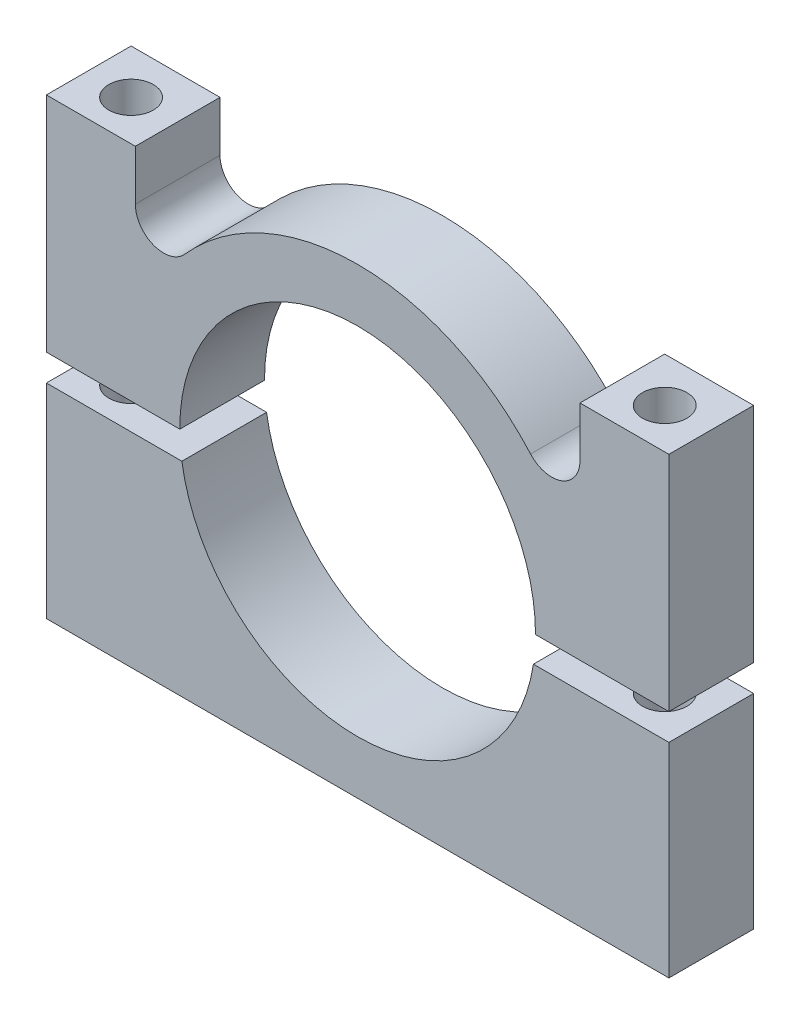
ISO-10303-21;
HEADER;
FILE_DESCRIPTION(('STEP AP214'),'2;1');
FILE_NAME('part.step','',(''),(''),'','','');
FILE_SCHEMA(('AUTOMOTIVE_DESIGN { 1 0 10303 214 1 1 1 1 }'));
ENDSEC;
DATA;
#1=APPLICATION_CONTEXT('core data for automotive mechanical design processes');
#2=APPLICATION_PROTOCOL_DEFINITION('international standard','automotive_design',2000,#1);
#3=PRODUCT_CONTEXT('',#1,'mechanical');
#4=PRODUCT('Part','Part','',(#3));
#5=PRODUCT_RELATED_PRODUCT_CATEGORY('part','',(#4));
#6=PRODUCT_DEFINITION_FORMATION('','',#4);
#7=PRODUCT_DEFINITION_CONTEXT('part definition',#1,'design');
#8=PRODUCT_DEFINITION('design','',#6,#7);
#9=PRODUCT_DEFINITION_SHAPE('','',#8);
#10=(LENGTH_UNIT() NAMED_UNIT(*) SI_UNIT(.MILLI.,.METRE.));
#11=(NAMED_UNIT(*) PLANE_ANGLE_UNIT() SI_UNIT($,.RADIAN.));
#12=(NAMED_UNIT(*) SI_UNIT($,.STERADIAN.) SOLID_ANGLE_UNIT());
#13=UNCERTAINTY_MEASURE_WITH_UNIT(LENGTH_MEASURE(1.E-05),#10,'distance_accuracy_value','');
#14=(GEOMETRIC_REPRESENTATION_CONTEXT(3) GLOBAL_UNCERTAINTY_ASSIGNED_CONTEXT((#13)) GLOBAL_UNIT_ASSIGNED_CONTEXT((#10,
#11,#12)) REPRESENTATION_CONTEXT('',''));
#15=CARTESIAN_POINT('',(0.,0.,0.));
#16=DIRECTION('',(0.,0.,1.));
#17=DIRECTION('',(1.,0.,0.));
#18=AXIS2_PLACEMENT_3D('',#15,#16,#17);
#19=CARTESIAN_POINT('',(-17.5,-0.0264974554359716,4.763));
#20=DIRECTION('',(1.,0.,0.));
#21=DIRECTION('',(0.,0.,-1.));
#22=AXIS2_PLACEMENT_3D('',#19,#20,#21);
#23=PLANE('',#22);
#24=DIRECTION('',(0.,-1.,0.));
#25=VECTOR('',#24,1.);
#26=CARTESIAN_POINT('',(-17.5,-0.0264974554359716,0.));
#27=LINE('',#26,#25);
#28=CARTESIAN_POINT('',(-17.5,12.5,0.));
#29=VERTEX_POINT('',#28);
#30=CARTESIAN_POINT('',(-17.5,-0.0264974554359716,0.));
#31=VERTEX_POINT('',#30);
#32=EDGE_CURVE('E163',#29,#31,#27,.T.);
#33=ORIENTED_EDGE('',*,*,#32,.T.);
#34=DIRECTION('',(0.,0.,-1.));
#35=VECTOR('',#34,1.);
#36=CARTESIAN_POINT('',(-17.5,-0.0264974554359716,4.763));
#37=LINE('',#36,#35);
#38=CARTESIAN_POINT('',(-17.5,-0.0264974554359716,4.763));
#39=VERTEX_POINT('',#38);
#40=EDGE_CURVE('E12',#39,#31,#37,.T.);
#41=ORIENTED_EDGE('',*,*,#40,.F.);
#42=DIRECTION('',(0.,-1.,0.));
#43=VECTOR('',#42,1.);
#44=CARTESIAN_POINT('',(-17.5,-0.0264974554359716,4.763));
#45=LINE('',#44,#43);
#46=CARTESIAN_POINT('',(-17.5,12.5,4.763));
#47=VERTEX_POINT('',#46);
#48=EDGE_CURVE('E186',#47,#39,#45,.T.);
#49=ORIENTED_EDGE('',*,*,#48,.F.);
#50=DIRECTION('',(0.,0.,-1.));
#51=VECTOR('',#50,1.);
#52=CARTESIAN_POINT('',(-17.5,12.5,4.763));
#53=LINE('',#52,#51);
#54=EDGE_CURVE('E159',#47,#29,#53,.T.);
#55=ORIENTED_EDGE('',*,*,#54,.T.);
#56=EDGE_LOOP('',(#33,#41,#49,#55));
#57=FACE_BOUND('',#56,.T.);
#58=ADVANCED_FACE('F43',(#57),#23,.F.);
#59=CARTESIAN_POINT('',(-17.5,-0.0264974554359716,4.763));
#60=DIRECTION('',(0.,1.,0.));
#61=DIRECTION('',(0.,0.,1.));
#62=AXIS2_PLACEMENT_3D('',#59,#60,#61);
#63=PLANE('',#62);
#64=CARTESIAN_POINT('',(-15.0028099543165,-0.0264974554359722,2.49999842083085));
#65=DIRECTION('',(0.,1.,0.));
#66=DIRECTION('',(0.,0.,1.));
#67=AXIS2_PLACEMENT_3D('',#64,#65,#66);
#68=CIRCLE('',#67,1.24999999999999);
#69=CARTESIAN_POINT('',(-15.0028099543165,-0.0264974554359722,3.74999842083084));
#70=VERTEX_POINT('',#69);
#71=EDGE_CURVE('E167',#70,#70,#68,.T.);
#72=ORIENTED_EDGE('',*,*,#71,.T.);
#73=EDGE_LOOP('',(#72));
#74=FACE_BOUND('',#73,.T.);
#75=DIRECTION('',(1.,0.,0.));
#76=VECTOR('',#75,1.);
#77=CARTESIAN_POINT('',(-17.5,-0.0264974554359716,0.));
#78=LINE('',#77,#76);
#79=CARTESIAN_POINT('',(-9.99996489418115,-0.0264974554359728,0.));
#80=VERTEX_POINT('',#79);
#81=EDGE_CURVE('E166',#31,#80,#78,.T.);
#82=ORIENTED_EDGE('',*,*,#81,.T.);
#83=DIRECTION('',(0.,0.,-1.));
#84=VECTOR('',#83,1.);
#85=CARTESIAN_POINT('',(-9.99996489418115,-0.0264974554359728,4.763));
#86=LINE('',#85,#84);
#87=CARTESIAN_POINT('',(-9.99996489418115,-0.0264974554359728,4.763));
#88=VERTEX_POINT('',#87);
#89=EDGE_CURVE('E51',#88,#80,#86,.T.);
#90=ORIENTED_EDGE('',*,*,#89,.F.);
#91=DIRECTION('',(1.,0.,0.));
#92=VECTOR('',#91,1.);
#93=CARTESIAN_POINT('',(-17.5,-0.0264974554359716,4.763));
#94=LINE('',#93,#92);
#95=EDGE_CURVE('E114',#39,#88,#94,.T.);
#96=ORIENTED_EDGE('',*,*,#95,.F.);
#97=ORIENTED_EDGE('',*,*,#40,.T.);
#98=EDGE_LOOP('',(#82,#90,#96,#97));
#99=FACE_BOUND('',#98,.T.);
#100=ADVANCED_FACE('F266',(#74,#99),#63,.F.);
#101=CARTESIAN_POINT('',(0.,0.,4.763));
#102=DIRECTION('',(0.,0.,-1.));
#103=DIRECTION('',(-1.,0.,0.));
#104=AXIS2_PLACEMENT_3D('',#101,#102,#103);
#105=CYLINDRICAL_SURFACE('',#104,10.);
#106=CARTESIAN_POINT('',(0.,0.,0.));
#107=DIRECTION('',(0.,0.,-1.));
#108=DIRECTION('',(1.,0.,0.));
#109=AXIS2_PLACEMENT_3D('',#106,#107,#108);
#110=CIRCLE('',#109,10.);
#111=CARTESIAN_POINT('',(9.99996489418115,-0.0264974554359716,0.));
#112=VERTEX_POINT('',#111);
#113=EDGE_CURVE('E169',#80,#112,#110,.T.);
#114=ORIENTED_EDGE('',*,*,#113,.T.);
#115=DIRECTION('',(0.,0.,-1.));
#116=VECTOR('',#115,1.);
#117=CARTESIAN_POINT('',(9.99996489418115,-0.0264974554359716,4.763));
#118=LINE('',#117,#116);
#119=CARTESIAN_POINT('',(9.99996489418115,-0.0264974554359716,4.763));
#120=VERTEX_POINT('',#119);
#121=EDGE_CURVE('E205',#120,#112,#118,.T.);
#122=ORIENTED_EDGE('',*,*,#121,.F.);
#123=CARTESIAN_POINT('',(0.,0.,4.763));
#124=DIRECTION('',(0.,0.,-1.));
#125=DIRECTION('',(1.,0.,0.));
#126=AXIS2_PLACEMENT_3D('',#123,#124,#125);
#127=CIRCLE('',#126,10.);
#128=EDGE_CURVE('E213',#88,#120,#127,.T.);
#129=ORIENTED_EDGE('',*,*,#128,.F.);
#130=ORIENTED_EDGE('',*,*,#89,.T.);
#131=EDGE_LOOP('',(#114,#122,#129,#130));
#132=FACE_BOUND('',#131,.T.);
#133=ADVANCED_FACE('F211',(#132),#105,.F.);
#134=CARTESIAN_POINT('',(9.99996489418115,-0.0264974554359716,4.763));
#135=DIRECTION('',(0.,1.,0.));
#136=DIRECTION('',(0.,0.,1.));
#137=AXIS2_PLACEMENT_3D('',#134,#135,#136);
#138=PLANE('',#137);
#139=CARTESIAN_POINT('',(15.0028099543165,-0.0264974554359722,2.49999842083085));
#140=DIRECTION('',(0.,1.,0.));
#141=DIRECTION('',(0.,0.,1.));
#142=AXIS2_PLACEMENT_3D('',#139,#140,#141);
#143=CIRCLE('',#142,1.24999999999999);
#144=CARTESIAN_POINT('',(15.0028099543165,-0.0264974554359722,3.74999842083084));
#145=VERTEX_POINT('',#144);
#146=EDGE_CURVE('E370',#145,#145,#143,.T.);
#147=ORIENTED_EDGE('',*,*,#146,.T.);
#148=EDGE_LOOP('',(#147));
#149=FACE_BOUND('',#148,.T.);
#150=DIRECTION('',(1.,0.,0.));
#151=VECTOR('',#150,1.);
#152=CARTESIAN_POINT('',(9.99996489418115,-0.0264974554359716,0.));
#153=LINE('',#152,#151);
#154=CARTESIAN_POINT('',(17.5,-0.0264974554359716,0.));
#155=VERTEX_POINT('',#154);
#156=EDGE_CURVE('E171',#112,#155,#153,.T.);
#157=ORIENTED_EDGE('',*,*,#156,.T.);
#158=DIRECTION('',(0.,0.,-1.));
#159=VECTOR('',#158,1.);
#160=CARTESIAN_POINT('',(17.5,-0.0264974554359716,4.763));
#161=LINE('',#160,#159);
#162=CARTESIAN_POINT('',(17.5,-0.0264974554359716,4.763));
#163=VERTEX_POINT('',#162);
#164=EDGE_CURVE('E202',#163,#155,#161,.T.);
#165=ORIENTED_EDGE('',*,*,#164,.F.);
#166=DIRECTION('',(1.,0.,0.));
#167=VECTOR('',#166,1.);
#168=CARTESIAN_POINT('',(9.99996489418115,-0.0264974554359716,4.763));
#169=LINE('',#168,#167);
#170=EDGE_CURVE('E231',#120,#163,#169,.T.);
#171=ORIENTED_EDGE('',*,*,#170,.F.);
#172=ORIENTED_EDGE('',*,*,#121,.T.);
#173=EDGE_LOOP('',(#157,#165,#171,#172));
#174=FACE_BOUND('',#173,.T.);
#175=ADVANCED_FACE('F222',(#149,#174),#138,.F.);
#176=CARTESIAN_POINT('',(17.5,12.5,4.763));
#177=DIRECTION('',(-1.,0.,0.));
#178=DIRECTION('',(0.,-1.,0.));
#179=AXIS2_PLACEMENT_3D('',#176,#177,#178);
#180=PLANE('',#179);
#181=DIRECTION('',(0.,1.,0.));
#182=VECTOR('',#181,1.);
#183=CARTESIAN_POINT('',(17.5,12.5,0.));
#184=LINE('',#183,#182);
#185=CARTESIAN_POINT('',(17.5,12.5,0.));
#186=VERTEX_POINT('',#185);
#187=EDGE_CURVE('E173',#155,#186,#184,.T.);
#188=ORIENTED_EDGE('',*,*,#187,.T.);
#189=DIRECTION('',(0.,0.,-1.));
#190=VECTOR('',#189,1.);
#191=CARTESIAN_POINT('',(17.5,12.5,4.763));
#192=LINE('',#191,#190);
#193=CARTESIAN_POINT('',(17.5,12.5,4.763));
#194=VERTEX_POINT('',#193);
#195=EDGE_CURVE('E199',#194,#186,#192,.T.);
#196=ORIENTED_EDGE('',*,*,#195,.F.);
#197=DIRECTION('',(0.,1.,0.));
#198=VECTOR('',#197,1.);
#199=CARTESIAN_POINT('',(17.5,12.5,4.763));
#200=LINE('',#199,#198);
#201=EDGE_CURVE('E228',#163,#194,#200,.T.);
#202=ORIENTED_EDGE('',*,*,#201,.F.);
#203=ORIENTED_EDGE('',*,*,#164,.T.);
#204=EDGE_LOOP('',(#188,#196,#202,#203));
#205=FACE_BOUND('',#204,.T.);
#206=ADVANCED_FACE('F226',(#205),#180,.F.);
#207=CARTESIAN_POINT('',(12.5,12.5,4.763));
#208=DIRECTION('',(0.,-1.,0.));
#209=DIRECTION('',(0.,0.,-1.));
#210=AXIS2_PLACEMENT_3D('',#207,#208,#209);
#211=PLANE('',#210);
#212=CARTESIAN_POINT('',(15.0028099543165,12.5,2.49999842083085));
#213=DIRECTION('',(0.,1.,0.));
#214=DIRECTION('',(0.,0.,1.));
#215=AXIS2_PLACEMENT_3D('',#212,#213,#214);
#216=CIRCLE('',#215,1.24999999999999);
#217=CARTESIAN_POINT('',(15.0028099543165,12.5,3.74999842083084));
#218=VERTEX_POINT('',#217);
#219=EDGE_CURVE('E367',#218,#218,#216,.T.);
#220=ORIENTED_EDGE('',*,*,#219,.F.);
#221=EDGE_LOOP('',(#220));
#222=FACE_BOUND('',#221,.T.);
#223=DIRECTION('',(-1.,0.,0.));
#224=VECTOR('',#223,1.);
#225=CARTESIAN_POINT('',(12.5,12.5,0.));
#226=LINE('',#225,#224);
#227=CARTESIAN_POINT('',(12.5,12.5,0.));
#228=VERTEX_POINT('',#227);
#229=EDGE_CURVE('E175',#186,#228,#226,.T.);
#230=ORIENTED_EDGE('',*,*,#229,.T.);
#231=DIRECTION('',(0.,0.,-1.));
#232=VECTOR('',#231,1.);
#233=CARTESIAN_POINT('',(12.5,12.5,4.763));
#234=LINE('',#233,#232);
#235=CARTESIAN_POINT('',(12.5,12.5,4.763));
#236=VERTEX_POINT('',#235);
#237=EDGE_CURVE('E196',#236,#228,#234,.T.);
#238=ORIENTED_EDGE('',*,*,#237,.F.);
#239=DIRECTION('',(-1.,0.,0.));
#240=VECTOR('',#239,1.);
#241=CARTESIAN_POINT('',(12.5,12.5,4.763));
#242=LINE('',#241,#240);
#243=EDGE_CURVE('E230',#194,#236,#242,.T.);
#244=ORIENTED_EDGE('',*,*,#243,.F.);
#245=ORIENTED_EDGE('',*,*,#195,.T.);
#246=EDGE_LOOP('',(#230,#238,#244,#245));
#247=FACE_BOUND('',#246,.T.);
#248=ADVANCED_FACE('F282',(#222,#247),#211,.F.);
#249=CARTESIAN_POINT('',(12.5,12.5,4.763));
#250=DIRECTION('',(1.,0.,0.));
#251=DIRECTION('',(0.,0.,-1.));
#252=AXIS2_PLACEMENT_3D('',#249,#250,#251);
#253=PLANE('',#252);
#254=DIRECTION('',(0.,-1.,0.));
#255=VECTOR('',#254,1.);
#256=CARTESIAN_POINT('',(12.5,12.5,0.));
#257=LINE('',#256,#255);
#258=CARTESIAN_POINT('',(12.5,9.68052168015753,0.));
#259=VERTEX_POINT('',#258);
#260=EDGE_CURVE('E177',#228,#259,#257,.T.);
#261=ORIENTED_EDGE('',*,*,#260,.T.);
#262=DIRECTION('',(0.,0.,-1.));
#263=VECTOR('',#262,1.);
#264=CARTESIAN_POINT('',(12.5,9.68052168015753,4.763));
#265=LINE('',#264,#263);
#266=CARTESIAN_POINT('',(12.5,9.68052168015753,4.763));
#267=VERTEX_POINT('',#266);
#268=EDGE_CURVE('E193',#267,#259,#265,.T.);
#269=ORIENTED_EDGE('',*,*,#268,.F.);
#270=DIRECTION('',(0.,-1.,0.));
#271=VECTOR('',#270,1.);
#272=CARTESIAN_POINT('',(12.5,12.5,4.763));
#273=LINE('',#272,#271);
#274=EDGE_CURVE('E233',#236,#267,#273,.T.);
#275=ORIENTED_EDGE('',*,*,#274,.F.);
#276=ORIENTED_EDGE('',*,*,#237,.T.);
#277=EDGE_LOOP('',(#261,#269,#275,#276));
#278=FACE_BOUND('',#277,.T.);
#279=ADVANCED_FACE('F285',(#278),#253,.F.);
#280=CARTESIAN_POINT('',(10.9125,9.68052168015753,4.763));
#281=DIRECTION('',(0.,0.,-1.));
#282=DIRECTION('',(-1.,0.,0.));
#283=AXIS2_PLACEMENT_3D('',#280,#281,#282);
#284=CYLINDRICAL_SURFACE('',#283,1.5875);
#285=CARTESIAN_POINT('',(10.9125,9.68052168015753,0.));
#286=DIRECTION('',(0.,0.,-1.));
#287=DIRECTION('',(-1.,0.,0.));
#288=AXIS2_PLACEMENT_3D('',#285,#286,#287);
#289=CIRCLE('',#288,1.5875);
#290=CARTESIAN_POINT('',(9.72493573264782,8.62702874666996,0.));
#291=VERTEX_POINT('',#290);
#292=EDGE_CURVE('E179',#259,#291,#289,.T.);
#293=ORIENTED_EDGE('',*,*,#292,.T.);
#294=DIRECTION('',(0.,0.,-1.));
#295=VECTOR('',#294,1.);
#296=CARTESIAN_POINT('',(9.72493573264782,8.62702874666996,4.763));
#297=LINE('',#296,#295);
#298=CARTESIAN_POINT('',(9.72493573264782,8.62702874666996,4.763));
#299=VERTEX_POINT('',#298);
#300=EDGE_CURVE('E190',#299,#291,#297,.T.);
#301=ORIENTED_EDGE('',*,*,#300,.F.);
#302=CARTESIAN_POINT('',(10.9125,9.68052168015753,4.763));
#303=DIRECTION('',(0.,0.,-1.));
#304=DIRECTION('',(-1.,0.,0.));
#305=AXIS2_PLACEMENT_3D('',#302,#303,#304);
#306=CIRCLE('',#305,1.5875);
#307=EDGE_CURVE('E239',#267,#299,#306,.T.);
#308=ORIENTED_EDGE('',*,*,#307,.F.);
#309=ORIENTED_EDGE('',*,*,#268,.T.);
#310=EDGE_LOOP('',(#293,#301,#308,#309));
#311=FACE_BOUND('',#310,.T.);
#312=ADVANCED_FACE('F245',(#311),#284,.F.);
#313=CARTESIAN_POINT('',(0.,0.,4.763));
#314=DIRECTION('',(0.,0.,-1.));
#315=DIRECTION('',(-1.,0.,0.));
#316=AXIS2_PLACEMENT_3D('',#313,#314,#315);
#317=CYLINDRICAL_SURFACE('',#316,13.);
#318=CARTESIAN_POINT('',(0.,0.,0.));
#319=DIRECTION('',(0.,0.,1.));
#320=DIRECTION('',(1.,0.,0.));
#321=AXIS2_PLACEMENT_3D('',#318,#319,#320);
#322=CIRCLE('',#321,13.);
#323=CARTESIAN_POINT('',(-9.72493573264782,8.62702874666995,0.));
#324=VERTEX_POINT('',#323);
#325=EDGE_CURVE('E181',#291,#324,#322,.T.);
#326=ORIENTED_EDGE('',*,*,#325,.T.);
#327=DIRECTION('',(0.,0.,-1.));
#328=VECTOR('',#327,1.);
#329=CARTESIAN_POINT('',(-9.72493573264782,8.62702874666995,4.763));
#330=LINE('',#329,#328);
#331=CARTESIAN_POINT('',(-9.72493573264782,8.62702874666995,4.763));
#332=VERTEX_POINT('',#331);
#333=EDGE_CURVE('E154',#332,#324,#330,.T.);
#334=ORIENTED_EDGE('',*,*,#333,.F.);
#335=CARTESIAN_POINT('',(0.,0.,4.763));
#336=DIRECTION('',(0.,0.,1.));
#337=DIRECTION('',(1.,0.,0.));
#338=AXIS2_PLACEMENT_3D('',#335,#336,#337);
#339=CIRCLE('',#338,13.);
#340=EDGE_CURVE('E145',#299,#332,#339,.T.);
#341=ORIENTED_EDGE('',*,*,#340,.F.);
#342=ORIENTED_EDGE('',*,*,#300,.T.);
#343=EDGE_LOOP('',(#326,#334,#341,#342));
#344=FACE_BOUND('',#343,.T.);
#345=ADVANCED_FACE('F249',(#344),#317,.T.);
#346=CARTESIAN_POINT('',(-10.9125,9.68052168015753,4.763));
#347=DIRECTION('',(0.,0.,-1.));
#348=DIRECTION('',(-1.,0.,0.));
#349=AXIS2_PLACEMENT_3D('',#346,#347,#348);
#350=CYLINDRICAL_SURFACE('',#349,1.5875);
#351=CARTESIAN_POINT('',(-10.9125,9.68052168015753,0.));
#352=DIRECTION('',(0.,0.,-1.));
#353=DIRECTION('',(-1.,0.,0.));
#354=AXIS2_PLACEMENT_3D('',#351,#352,#353);
#355=CIRCLE('',#354,1.5875);
#356=CARTESIAN_POINT('',(-12.5,9.68052168015753,0.));
#357=VERTEX_POINT('',#356);
#358=EDGE_CURVE('E153',#324,#357,#355,.T.);
#359=ORIENTED_EDGE('',*,*,#358,.T.);
#360=DIRECTION('',(0.,0.,-1.));
#361=VECTOR('',#360,1.);
#362=CARTESIAN_POINT('',(-12.5,9.68052168015753,4.763));
#363=LINE('',#362,#361);
#364=CARTESIAN_POINT('',(-12.5,9.68052168015753,4.763));
#365=VERTEX_POINT('',#364);
#366=EDGE_CURVE('E150',#365,#357,#363,.T.);
#367=ORIENTED_EDGE('',*,*,#366,.F.);
#368=CARTESIAN_POINT('',(-10.9125,9.68052168015753,4.763));
#369=DIRECTION('',(0.,0.,-1.));
#370=DIRECTION('',(-1.,0.,0.));
#371=AXIS2_PLACEMENT_3D('',#368,#369,#370);
#372=CIRCLE('',#371,1.5875);
#373=EDGE_CURVE('E139',#332,#365,#372,.T.);
#374=ORIENTED_EDGE('',*,*,#373,.F.);
#375=ORIENTED_EDGE('',*,*,#333,.T.);
#376=EDGE_LOOP('',(#359,#367,#374,#375));
#377=FACE_BOUND('',#376,.T.);
#378=ADVANCED_FACE('F151',(#377),#350,.F.);
#379=CARTESIAN_POINT('',(-12.5,12.5,4.763));
#380=DIRECTION('',(-1.,0.,0.));
#381=DIRECTION('',(0.,0.,1.));
#382=AXIS2_PLACEMENT_3D('',#379,#380,#381);
#383=PLANE('',#382);
#384=DIRECTION('',(0.,1.,0.));
#385=VECTOR('',#384,1.);
#386=CARTESIAN_POINT('',(-12.5,12.5,0.));
#387=LINE('',#386,#385);
#388=CARTESIAN_POINT('',(-12.5,12.5,0.));
#389=VERTEX_POINT('',#388);
#390=EDGE_CURVE('E100',#357,#389,#387,.T.);
#391=ORIENTED_EDGE('',*,*,#390,.T.);
#392=DIRECTION('',(0.,0.,-1.));
#393=VECTOR('',#392,1.);
#394=CARTESIAN_POINT('',(-12.5,12.5,4.763));
#395=LINE('',#394,#393);
#396=CARTESIAN_POINT('',(-12.5,12.5,4.763));
#397=VERTEX_POINT('',#396);
#398=EDGE_CURVE('E155',#397,#389,#395,.T.);
#399=ORIENTED_EDGE('',*,*,#398,.F.);
#400=DIRECTION('',(0.,1.,0.));
#401=VECTOR('',#400,1.);
#402=CARTESIAN_POINT('',(-12.5,12.5,4.763));
#403=LINE('',#402,#401);
#404=EDGE_CURVE('E143',#365,#397,#403,.T.);
#405=ORIENTED_EDGE('',*,*,#404,.F.);
#406=ORIENTED_EDGE('',*,*,#366,.T.);
#407=EDGE_LOOP('',(#391,#399,#405,#406));
#408=FACE_BOUND('',#407,.T.);
#409=ADVANCED_FACE('F157',(#408),#383,.F.);
#410=CARTESIAN_POINT('',(-17.5,12.5,4.763));
#411=DIRECTION('',(0.,-1.,0.));
#412=DIRECTION('',(0.,0.,-1.));
#413=AXIS2_PLACEMENT_3D('',#410,#411,#412);
#414=PLANE('',#413);
#415=CARTESIAN_POINT('',(-15.0028099543165,12.5,2.49999842083085));
#416=DIRECTION('',(0.,1.,0.));
#417=DIRECTION('',(0.,0.,1.));
#418=AXIS2_PLACEMENT_3D('',#415,#416,#417);
#419=CIRCLE('',#418,1.24999999999999);
#420=CARTESIAN_POINT('',(-15.0028099543165,12.5,3.74999842083084));
#421=VERTEX_POINT('',#420);
#422=EDGE_CURVE('E371',#421,#421,#419,.T.);
#423=ORIENTED_EDGE('',*,*,#422,.F.);
#424=EDGE_LOOP('',(#423));
#425=FACE_BOUND('',#424,.T.);
#426=DIRECTION('',(-1.,0.,0.));
#427=VECTOR('',#426,1.);
#428=CARTESIAN_POINT('',(-17.5,12.5,0.));
#429=LINE('',#428,#427);
#430=EDGE_CURVE('E106',#389,#29,#429,.T.);
#431=ORIENTED_EDGE('',*,*,#430,.T.);
#432=ORIENTED_EDGE('',*,*,#54,.F.);
#433=DIRECTION('',(-1.,0.,0.));
#434=VECTOR('',#433,1.);
#435=CARTESIAN_POINT('',(-17.5,12.5,4.763));
#436=LINE('',#435,#434);
#437=EDGE_CURVE('E59',#397,#47,#436,.T.);
#438=ORIENTED_EDGE('',*,*,#437,.F.);
#439=ORIENTED_EDGE('',*,*,#398,.T.);
#440=EDGE_LOOP('',(#431,#432,#438,#439));
#441=FACE_BOUND('',#440,.T.);
#442=ADVANCED_FACE('F253',(#425,#441),#414,.F.);
#443=CARTESIAN_POINT('',(-10.9125,9.68052168015753,4.763));
#444=DIRECTION('',(0.,0.,-1.));
#445=DIRECTION('',(-1.,0.,0.));
#446=AXIS2_PLACEMENT_3D('',#443,#444,#445);
#447=PLANE('',#446);
#448=ORIENTED_EDGE('',*,*,#48,.T.);
#449=ORIENTED_EDGE('',*,*,#95,.T.);
#450=ORIENTED_EDGE('',*,*,#128,.T.);
#451=ORIENTED_EDGE('',*,*,#170,.T.);
#452=ORIENTED_EDGE('',*,*,#201,.T.);
#453=ORIENTED_EDGE('',*,*,#243,.T.);
#454=ORIENTED_EDGE('',*,*,#274,.T.);
#455=ORIENTED_EDGE('',*,*,#307,.T.);
#456=ORIENTED_EDGE('',*,*,#340,.T.);
#457=ORIENTED_EDGE('',*,*,#373,.T.);
#458=ORIENTED_EDGE('',*,*,#404,.T.);
#459=ORIENTED_EDGE('',*,*,#437,.T.);
#460=EDGE_LOOP('',(#448,#449,#450,#451,#452,#453,#454,#455,#456,#457,#458,#459));
#461=FACE_BOUND('',#460,.T.);
#462=ADVANCED_FACE('F141',(#461),#447,.F.);
#463=CARTESIAN_POINT('',(-10.9125,9.68052168015753,0.));
#464=DIRECTION('',(0.,0.,-1.));
#465=DIRECTION('',(-1.,0.,0.));
#466=AXIS2_PLACEMENT_3D('',#463,#464,#465);
#467=PLANE('',#466);
#468=ORIENTED_EDGE('',*,*,#32,.F.);
#469=ORIENTED_EDGE('',*,*,#430,.F.);
#470=ORIENTED_EDGE('',*,*,#390,.F.);
#471=ORIENTED_EDGE('',*,*,#358,.F.);
#472=ORIENTED_EDGE('',*,*,#325,.F.);
#473=ORIENTED_EDGE('',*,*,#292,.F.);
#474=ORIENTED_EDGE('',*,*,#260,.F.);
#475=ORIENTED_EDGE('',*,*,#229,.F.);
#476=ORIENTED_EDGE('',*,*,#187,.F.);
#477=ORIENTED_EDGE('',*,*,#156,.F.);
#478=ORIENTED_EDGE('',*,*,#113,.F.);
#479=ORIENTED_EDGE('',*,*,#81,.F.);
#480=EDGE_LOOP('',(#468,#469,#470,#471,#472,#473,#474,#475,#476,#477,#478,#479));
#481=FACE_BOUND('',#480,.T.);
#482=ADVANCED_FACE('F217',(#481),#467,.T.);
#483=CARTESIAN_POINT('',(-15.0028099543165,12.5,2.49999842083085));
#484=DIRECTION('',(0.,1.,0.));
#485=DIRECTION('',(0.,0.,1.));
#486=AXIS2_PLACEMENT_3D('',#483,#484,#485);
#487=CYLINDRICAL_SURFACE('',#486,1.24999999999999);
#488=ORIENTED_EDGE('',*,*,#422,.T.);
#489=EDGE_LOOP('',(#488));
#490=FACE_BOUND('',#489,.T.);
#491=ORIENTED_EDGE('',*,*,#71,.F.);
#492=EDGE_LOOP('',(#491));
#493=FACE_BOUND('',#492,.T.);
#494=ADVANCED_FACE('F318',(#490,#493),#487,.F.);
#495=CARTESIAN_POINT('',(15.0028099543165,12.5,2.49999842083085));
#496=DIRECTION('',(0.,1.,0.));
#497=DIRECTION('',(0.,0.,1.));
#498=AXIS2_PLACEMENT_3D('',#495,#496,#497);
#499=CYLINDRICAL_SURFACE('',#498,1.24999999999999);
#500=ORIENTED_EDGE('',*,*,#219,.T.);
#501=EDGE_LOOP('',(#500));
#502=FACE_BOUND('',#501,.T.);
#503=ORIENTED_EDGE('',*,*,#146,.F.);
#504=EDGE_LOOP('',(#503));
#505=FACE_BOUND('',#504,.T.);
#506=ADVANCED_FACE('F336',(#502,#505),#499,.F.);
#507=CLOSED_SHELL('',(#58,#100,#133,#175,#206,#248,#279,#312,#345,#378,#409,#442,#462,#482,#494,#506));
#508=MANIFOLD_SOLID_BREP('B2',#507);
#509=CARTESIAN_POINT('',(0.,0.,4.763));
#510=DIRECTION('',(0.,0.,-1.));
#511=DIRECTION('',(-1.,0.,0.));
#512=AXIS2_PLACEMENT_3D('',#509,#510,#511);
#513=CYLINDRICAL_SURFACE('',#512,10.);
#514=CARTESIAN_POINT('',(0.,0.,0.));
#515=DIRECTION('',(0.,0.,-1.));
#516=DIRECTION('',(1.,0.,0.));
#517=AXIS2_PLACEMENT_3D('',#514,#515,#516);
#518=CIRCLE('',#517,10.);
#519=CARTESIAN_POINT('',(9.8828035252426,-1.52649745543597,0.));
#520=VERTEX_POINT('',#519);
#521=CARTESIAN_POINT('',(-9.8828035252426,-1.52649745543597,0.));
#522=VERTEX_POINT('',#521);
#523=EDGE_CURVE('E501',#520,#522,#518,.T.);
#524=ORIENTED_EDGE('',*,*,#523,.T.);
#525=DIRECTION('',(0.,0.,-1.));
#526=VECTOR('',#525,1.);
#527=CARTESIAN_POINT('',(-9.8828035252426,-1.52649745543597,4.763));
#528=LINE('',#527,#526);
#529=CARTESIAN_POINT('',(-9.8828035252426,-1.52649745543597,4.763));
#530=VERTEX_POINT('',#529);
#531=EDGE_CURVE('E41',#530,#522,#528,.T.);
#532=ORIENTED_EDGE('',*,*,#531,.F.);
#533=CARTESIAN_POINT('',(0.,0.,4.763));
#534=DIRECTION('',(0.,0.,-1.));
#535=DIRECTION('',(1.,0.,0.));
#536=AXIS2_PLACEMENT_3D('',#533,#534,#535);
#537=CIRCLE('',#536,10.);
#538=CARTESIAN_POINT('',(9.8828035252426,-1.52649745543597,4.763));
#539=VERTEX_POINT('',#538);
#540=EDGE_CURVE('E512',#539,#530,#537,.T.);
#541=ORIENTED_EDGE('',*,*,#540,.F.);
#542=DIRECTION('',(0.,0.,-1.));
#543=VECTOR('',#542,1.);
#544=CARTESIAN_POINT('',(9.8828035252426,-1.52649745543597,4.763));
#545=LINE('',#544,#543);
#546=EDGE_CURVE('E497',#539,#520,#545,.T.);
#547=ORIENTED_EDGE('',*,*,#546,.T.);
#548=EDGE_LOOP('',(#524,#532,#541,#547));
#549=FACE_BOUND('',#548,.T.);
#550=ADVANCED_FACE('F417',(#549),#513,.F.);
#551=CARTESIAN_POINT('',(-9.8828035252426,-1.52649745543597,4.763));
#552=DIRECTION('',(0.,-1.,0.));
#553=DIRECTION('',(1.,0.,0.));
#554=AXIS2_PLACEMENT_3D('',#551,#552,#553);
#555=PLANE('',#554);
#556=CARTESIAN_POINT('',(-15.0028099543165,-1.52649745543597,2.49999842083085));
#557=DIRECTION('',(0.,-1.,0.));
#558=DIRECTION('',(1.,0.,0.));
#559=AXIS2_PLACEMENT_3D('',#556,#557,#558);
#560=CIRCLE('',#559,1.24999999999999);
#561=CARTESIAN_POINT('',(-13.7528099543165,-1.52649745543597,2.49999842083085));
#562=VERTEX_POINT('',#561);
#563=EDGE_CURVE('E505',#562,#562,#560,.T.);
#564=ORIENTED_EDGE('',*,*,#563,.T.);
#565=EDGE_LOOP('',(#564));
#566=FACE_BOUND('',#565,.T.);
#567=DIRECTION('',(-1.,0.,0.));
#568=VECTOR('',#567,1.);
#569=CARTESIAN_POINT('',(-9.8828035252426,-1.52649745543597,0.));
#570=LINE('',#569,#568);
#571=CARTESIAN_POINT('',(-17.5,-1.52649745543597,0.));
#572=VERTEX_POINT('',#571);
#573=EDGE_CURVE('E504',#522,#572,#570,.T.);
#574=ORIENTED_EDGE('',*,*,#573,.T.);
#575=DIRECTION('',(0.,0.,-1.));
#576=VECTOR('',#575,1.);
#577=CARTESIAN_POINT('',(-17.5,-1.52649745543597,4.763));
#578=LINE('',#577,#576);
#579=CARTESIAN_POINT('',(-17.5,-1.52649745543597,4.763));
#580=VERTEX_POINT('',#579);
#581=EDGE_CURVE('E425',#580,#572,#578,.T.);
#582=ORIENTED_EDGE('',*,*,#581,.F.);
#583=DIRECTION('',(-1.,0.,0.));
#584=VECTOR('',#583,1.);
#585=CARTESIAN_POINT('',(-9.8828035252426,-1.52649745543597,4.763));
#586=LINE('',#585,#584);
#587=EDGE_CURVE('E470',#530,#580,#586,.T.);
#588=ORIENTED_EDGE('',*,*,#587,.F.);
#589=ORIENTED_EDGE('',*,*,#531,.T.);
#590=EDGE_LOOP('',(#574,#582,#588,#589));
#591=FACE_BOUND('',#590,.T.);
#592=ADVANCED_FACE('F538',(#566,#591),#555,.F.);
#593=CARTESIAN_POINT('',(-17.5,-13.,4.763));
#594=DIRECTION('',(1.,0.,0.));
#595=DIRECTION('',(0.,0.,-1.));
#596=AXIS2_PLACEMENT_3D('',#593,#594,#595);
#597=PLANE('',#596);
#598=DIRECTION('',(0.,-1.,0.));
#599=VECTOR('',#598,1.);
#600=CARTESIAN_POINT('',(-17.5,-13.,0.));
#601=LINE('',#600,#599);
#602=CARTESIAN_POINT('',(-17.5,-13.,0.));
#603=VERTEX_POINT('',#602);
#604=EDGE_CURVE('E507',#572,#603,#601,.T.);
#605=ORIENTED_EDGE('',*,*,#604,.T.);
#606=DIRECTION('',(0.,0.,-1.));
#607=VECTOR('',#606,1.);
#608=CARTESIAN_POINT('',(-17.5,-13.,4.763));
#609=LINE('',#608,#607);
#610=CARTESIAN_POINT('',(-17.5,-13.,4.763));
#611=VERTEX_POINT('',#610);
#612=EDGE_CURVE('E492',#611,#603,#609,.T.);
#613=ORIENTED_EDGE('',*,*,#612,.F.);
#614=DIRECTION('',(0.,-1.,0.));
#615=VECTOR('',#614,1.);
#616=CARTESIAN_POINT('',(-17.5,-13.,4.763));
#617=LINE('',#616,#615);
#618=EDGE_CURVE('E483',#580,#611,#617,.T.);
#619=ORIENTED_EDGE('',*,*,#618,.F.);
#620=ORIENTED_EDGE('',*,*,#581,.T.);
#621=EDGE_LOOP('',(#605,#613,#619,#620));
#622=FACE_BOUND('',#621,.T.);
#623=ADVANCED_FACE('F518',(#622),#597,.F.);
#624=CARTESIAN_POINT('',(17.5,-13.,4.763));
#625=DIRECTION('',(0.,1.,0.));
#626=DIRECTION('',(-1.,0.,0.));
#627=AXIS2_PLACEMENT_3D('',#624,#625,#626);
#628=PLANE('',#627);
#629=CARTESIAN_POINT('',(15.0028099543165,-13.,2.49999842083085));
#630=DIRECTION('',(0.,1.,0.));
#631=DIRECTION('',(0.,0.,1.));
#632=AXIS2_PLACEMENT_3D('',#629,#630,#631);
#633=CIRCLE('',#632,1.24999999999999);
#634=CARTESIAN_POINT('',(15.0028099543165,-13.,3.74999842083084));
#635=VERTEX_POINT('',#634);
#636=EDGE_CURVE('E556',#635,#635,#633,.T.);
#637=ORIENTED_EDGE('',*,*,#636,.T.);
#638=EDGE_LOOP('',(#637));
#639=FACE_BOUND('',#638,.T.);
#640=CARTESIAN_POINT('',(-15.0028099543165,-13.,2.49999842083085));
#641=DIRECTION('',(0.,1.,0.));
#642=DIRECTION('',(0.,0.,1.));
#643=AXIS2_PLACEMENT_3D('',#640,#641,#642);
#644=CIRCLE('',#643,1.24999999999999);
#645=CARTESIAN_POINT('',(-15.0028099543165,-13.,3.74999842083084));
#646=VERTEX_POINT('',#645);
#647=EDGE_CURVE('E559',#646,#646,#644,.T.);
#648=ORIENTED_EDGE('',*,*,#647,.T.);
#649=EDGE_LOOP('',(#648));
#650=FACE_BOUND('',#649,.T.);
#651=DIRECTION('',(1.,0.,0.));
#652=VECTOR('',#651,1.);
#653=CARTESIAN_POINT('',(17.5,-13.,0.));
#654=LINE('',#653,#652);
#655=CARTESIAN_POINT('',(17.5,-13.,0.));
#656=VERTEX_POINT('',#655);
#657=EDGE_CURVE('E491',#603,#656,#654,.T.);
#658=ORIENTED_EDGE('',*,*,#657,.T.);
#659=DIRECTION('',(0.,0.,-1.));
#660=VECTOR('',#659,1.);
#661=CARTESIAN_POINT('',(17.5,-13.,4.763));
#662=LINE('',#661,#660);
#663=CARTESIAN_POINT('',(17.5,-13.,4.763));
#664=VERTEX_POINT('',#663);
#665=EDGE_CURVE('E488',#664,#656,#662,.T.);
#666=ORIENTED_EDGE('',*,*,#665,.F.);
#667=DIRECTION('',(1.,0.,0.));
#668=VECTOR('',#667,1.);
#669=CARTESIAN_POINT('',(17.5,-13.,4.763));
#670=LINE('',#669,#668);
#671=EDGE_CURVE('E477',#611,#664,#670,.T.);
#672=ORIENTED_EDGE('',*,*,#671,.F.);
#673=ORIENTED_EDGE('',*,*,#612,.T.);
#674=EDGE_LOOP('',(#658,#666,#672,#673));
#675=FACE_BOUND('',#674,.T.);
#676=ADVANCED_FACE('F489',(#639,#650,#675),#628,.F.);
#677=CARTESIAN_POINT('',(17.5,-1.52649745543597,4.763));
#678=DIRECTION('',(-1.,0.,0.));
#679=DIRECTION('',(0.,0.,1.));
#680=AXIS2_PLACEMENT_3D('',#677,#678,#679);
#681=PLANE('',#680);
#682=DIRECTION('',(0.,1.,0.));
#683=VECTOR('',#682,1.);
#684=CARTESIAN_POINT('',(17.5,-1.52649745543597,0.));
#685=LINE('',#684,#683);
#686=CARTESIAN_POINT('',(17.5,-1.52649745543597,0.));
#687=VERTEX_POINT('',#686);
#688=EDGE_CURVE('E456',#656,#687,#685,.T.);
#689=ORIENTED_EDGE('',*,*,#688,.T.);
#690=DIRECTION('',(0.,0.,-1.));
#691=VECTOR('',#690,1.);
#692=CARTESIAN_POINT('',(17.5,-1.52649745543597,4.763));
#693=LINE('',#692,#691);
#694=CARTESIAN_POINT('',(17.5,-1.52649745543597,4.763));
#695=VERTEX_POINT('',#694);
#696=EDGE_CURVE('E493',#695,#687,#693,.T.);
#697=ORIENTED_EDGE('',*,*,#696,.F.);
#698=DIRECTION('',(0.,1.,0.));
#699=VECTOR('',#698,1.);
#700=CARTESIAN_POINT('',(17.5,-1.52649745543597,4.763));
#701=LINE('',#700,#699);
#702=EDGE_CURVE('E481',#664,#695,#701,.T.);
#703=ORIENTED_EDGE('',*,*,#702,.F.);
#704=ORIENTED_EDGE('',*,*,#665,.T.);
#705=EDGE_LOOP('',(#689,#697,#703,#704));
#706=FACE_BOUND('',#705,.T.);
#707=ADVANCED_FACE('F495',(#706),#681,.F.);
#708=CARTESIAN_POINT('',(17.5,-1.52649745543597,4.763));
#709=DIRECTION('',(0.,-1.,0.));
#710=DIRECTION('',(1.,0.,0.));
#711=AXIS2_PLACEMENT_3D('',#708,#709,#710);
#712=PLANE('',#711);
#713=CARTESIAN_POINT('',(15.0028099543165,-1.52649745543597,2.49999842083085));
#714=DIRECTION('',(0.,-1.,0.));
#715=DIRECTION('',(1.,0.,0.));
#716=AXIS2_PLACEMENT_3D('',#713,#714,#715);
#717=CIRCLE('',#716,1.24999999999999);
#718=CARTESIAN_POINT('',(16.2528099543165,-1.52649745543597,2.49999842083085));
#719=VERTEX_POINT('',#718);
#720=EDGE_CURVE('E561',#719,#719,#717,.T.);
#721=ORIENTED_EDGE('',*,*,#720,.T.);
#722=EDGE_LOOP('',(#721));
#723=FACE_BOUND('',#722,.T.);
#724=DIRECTION('',(-1.,0.,0.));
#725=VECTOR('',#724,1.);
#726=CARTESIAN_POINT('',(17.5,-1.52649745543597,0.));
#727=LINE('',#726,#725);
#728=EDGE_CURVE('E462',#687,#520,#727,.T.);
#729=ORIENTED_EDGE('',*,*,#728,.T.);
#730=ORIENTED_EDGE('',*,*,#546,.F.);
#731=DIRECTION('',(-1.,0.,0.));
#732=VECTOR('',#731,1.);
#733=CARTESIAN_POINT('',(17.5,-1.52649745543597,4.763));
#734=LINE('',#733,#732);
#735=EDGE_CURVE('E433',#695,#539,#734,.T.);
#736=ORIENTED_EDGE('',*,*,#735,.F.);
#737=ORIENTED_EDGE('',*,*,#696,.T.);
#738=EDGE_LOOP('',(#729,#730,#736,#737));
#739=FACE_BOUND('',#738,.T.);
#740=ADVANCED_FACE('F525',(#723,#739),#712,.F.);
#741=CARTESIAN_POINT('',(0.,0.,4.763));
#742=DIRECTION('',(0.,0.,1.));
#743=DIRECTION('',(1.,0.,0.));
#744=AXIS2_PLACEMENT_3D('',#741,#742,#743);
#745=PLANE('',#744);
#746=ORIENTED_EDGE('',*,*,#540,.T.);
#747=ORIENTED_EDGE('',*,*,#587,.T.);
#748=ORIENTED_EDGE('',*,*,#618,.T.);
#749=ORIENTED_EDGE('',*,*,#671,.T.);
#750=ORIENTED_EDGE('',*,*,#702,.T.);
#751=ORIENTED_EDGE('',*,*,#735,.T.);
#752=EDGE_LOOP('',(#746,#747,#748,#749,#750,#751));
#753=FACE_BOUND('',#752,.T.);
#754=ADVANCED_FACE('F479',(#753),#745,.T.);
#755=CARTESIAN_POINT('',(0.,0.,0.));
#756=DIRECTION('',(0.,0.,1.));
#757=DIRECTION('',(1.,0.,0.));
#758=AXIS2_PLACEMENT_3D('',#755,#756,#757);
#759=PLANE('',#758);
#760=ORIENTED_EDGE('',*,*,#523,.F.);
#761=ORIENTED_EDGE('',*,*,#728,.F.);
#762=ORIENTED_EDGE('',*,*,#688,.F.);
#763=ORIENTED_EDGE('',*,*,#657,.F.);
#764=ORIENTED_EDGE('',*,*,#604,.F.);
#765=ORIENTED_EDGE('',*,*,#573,.F.);
#766=EDGE_LOOP('',(#760,#761,#762,#763,#764,#765));
#767=FACE_BOUND('',#766,.T.);
#768=ADVANCED_FACE('F521',(#767),#759,.F.);
#769=CARTESIAN_POINT('',(-15.0028099543165,12.5,2.49999842083085));
#770=DIRECTION('',(0.,1.,0.));
#771=DIRECTION('',(0.,0.,1.));
#772=AXIS2_PLACEMENT_3D('',#769,#770,#771);
#773=CYLINDRICAL_SURFACE('',#772,1.24999999999999);
#774=ORIENTED_EDGE('',*,*,#647,.F.);
#775=EDGE_LOOP('',(#774));
#776=FACE_BOUND('',#775,.T.);
#777=ORIENTED_EDGE('',*,*,#563,.F.);
#778=EDGE_LOOP('',(#777));
#779=FACE_BOUND('',#778,.T.);
#780=ADVANCED_FACE('F572',(#776,#779),#773,.F.);
#781=CARTESIAN_POINT('',(15.0028099543165,12.5,2.49999842083085));
#782=DIRECTION('',(0.,1.,0.));
#783=DIRECTION('',(0.,0.,1.));
#784=AXIS2_PLACEMENT_3D('',#781,#782,#783);
#785=CYLINDRICAL_SURFACE('',#784,1.24999999999999);
#786=ORIENTED_EDGE('',*,*,#636,.F.);
#787=EDGE_LOOP('',(#786));
#788=FACE_BOUND('',#787,.T.);
#789=ORIENTED_EDGE('',*,*,#720,.F.);
#790=EDGE_LOOP('',(#789));
#791=FACE_BOUND('',#790,.T.);
#792=ADVANCED_FACE('F570',(#788,#791),#785,.F.);
#793=CLOSED_SHELL('',(#550,#592,#623,#676,#707,#740,#754,#768,#780,#792));
#794=MANIFOLD_SOLID_BREP('B6',#793);
#795=ADVANCED_BREP_SHAPE_REPRESENTATION('',(#18,#508,#794),#14);
#796=SHAPE_DEFINITION_REPRESENTATION(#9,#795);
ENDSEC;
END-ISO-10303-21;
